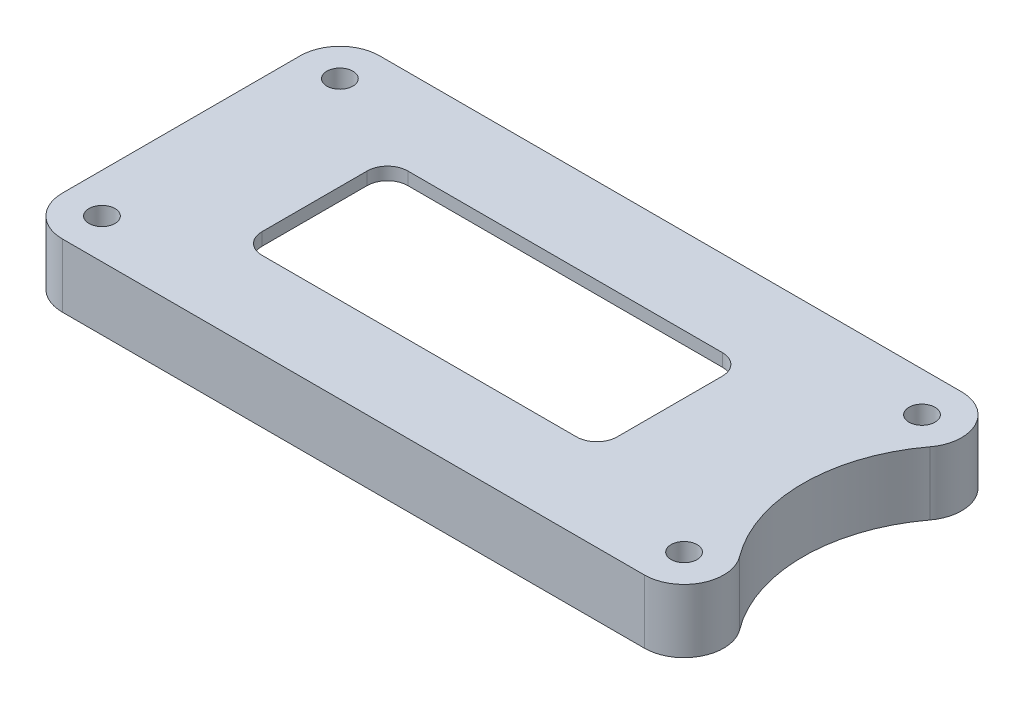
ISO-10303-21;
HEADER;
FILE_DESCRIPTION(('STEP AP214'),'2;1');
FILE_NAME('part.step','',(''),(''),'','','');
FILE_SCHEMA(('AUTOMOTIVE_DESIGN { 1 0 10303 214 1 1 1 1 }'));
ENDSEC;
DATA;
#1=APPLICATION_CONTEXT('core data for automotive mechanical design processes');
#2=APPLICATION_PROTOCOL_DEFINITION('international standard','automotive_design',2000,#1);
#3=PRODUCT_CONTEXT('',#1,'mechanical');
#4=PRODUCT('Part','Part','',(#3));
#5=PRODUCT_RELATED_PRODUCT_CATEGORY('part','',(#4));
#6=PRODUCT_DEFINITION_FORMATION('','',#4);
#7=PRODUCT_DEFINITION_CONTEXT('part definition',#1,'design');
#8=PRODUCT_DEFINITION('design','',#6,#7);
#9=PRODUCT_DEFINITION_SHAPE('','',#8);
#10=(LENGTH_UNIT() NAMED_UNIT(*) SI_UNIT(.MILLI.,.METRE.));
#11=(NAMED_UNIT(*) PLANE_ANGLE_UNIT() SI_UNIT($,.RADIAN.));
#12=(NAMED_UNIT(*) SI_UNIT($,.STERADIAN.) SOLID_ANGLE_UNIT());
#13=UNCERTAINTY_MEASURE_WITH_UNIT(LENGTH_MEASURE(1.E-05),#10,'distance_accuracy_value','');
#14=(GEOMETRIC_REPRESENTATION_CONTEXT(3) GLOBAL_UNCERTAINTY_ASSIGNED_CONTEXT((#13)) GLOBAL_UNIT_ASSIGNED_CONTEXT((#10,
#11,#12)) REPRESENTATION_CONTEXT('',''));
#15=CARTESIAN_POINT('',(0.,0.,0.));
#16=DIRECTION('',(0.,0.,1.));
#17=DIRECTION('',(1.,0.,0.));
#18=AXIS2_PLACEMENT_3D('',#15,#16,#17);
#19=CARTESIAN_POINT('',(0.,5.,0.));
#20=DIRECTION('',(0.,1.,0.));
#21=DIRECTION('',(0.,0.,1.));
#22=AXIS2_PLACEMENT_3D('',#19,#20,#21);
#23=PLANE('',#22);
#24=CARTESIAN_POINT('',(-21.375,5.,-9.37500000000001));
#25=DIRECTION('',(0.,-1.,0.));
#26=DIRECTION('',(0.,0.,-1.));
#27=AXIS2_PLACEMENT_3D('',#24,#25,#26);
#28=CIRCLE('',#27,1.025);
#29=CARTESIAN_POINT('',(-21.375,5.,-10.4));
#30=VERTEX_POINT('',#29);
#31=EDGE_CURVE('E459',#30,#30,#28,.T.);
#32=ORIENTED_EDGE('',*,*,#31,.T.);
#33=EDGE_LOOP('',(#32));
#34=FACE_BOUND('',#33,.T.);
#35=CARTESIAN_POINT('',(24.5,5.,9.37500000000001));
#36=DIRECTION('',(0.,-1.,0.));
#37=DIRECTION('',(0.,0.,-1.));
#38=AXIS2_PLACEMENT_3D('',#35,#36,#37);
#39=CIRCLE('',#38,1.025);
#40=CARTESIAN_POINT('',(24.5,5.,8.35));
#41=VERTEX_POINT('',#40);
#42=EDGE_CURVE('E454',#41,#41,#39,.F.);
#43=ORIENTED_EDGE('',*,*,#42,.F.);
#44=EDGE_LOOP('',(#43));
#45=FACE_BOUND('',#44,.T.);
#46=CARTESIAN_POINT('',(24.5,5.,-9.37500000000001));
#47=DIRECTION('',(0.,-1.,0.));
#48=DIRECTION('',(0.,0.,-1.));
#49=AXIS2_PLACEMENT_3D('',#46,#47,#48);
#50=CIRCLE('',#49,1.025);
#51=CARTESIAN_POINT('',(24.5,5.,-10.4));
#52=VERTEX_POINT('',#51);
#53=EDGE_CURVE('E447',#52,#52,#50,.T.);
#54=ORIENTED_EDGE('',*,*,#53,.T.);
#55=EDGE_LOOP('',(#54));
#56=FACE_BOUND('',#55,.T.);
#57=DIRECTION('',(-1.,0.,0.));
#58=VECTOR('',#57,1.);
#59=CARTESIAN_POINT('',(-22.5,5.,-12.5));
#60=LINE('',#59,#58);
#61=CARTESIAN_POINT('',(24.5,5.,-12.5));
#62=VERTEX_POINT('',#61);
#63=CARTESIAN_POINT('',(-21.375,5.,-12.5));
#64=VERTEX_POINT('',#63);
#65=EDGE_CURVE('E399',#62,#64,#60,.T.);
#66=ORIENTED_EDGE('',*,*,#65,.T.);
#67=CARTESIAN_POINT('',(-21.375,5.,-9.37500000000001));
#68=DIRECTION('',(0.,1.,0.));
#69=DIRECTION('',(0.,0.,1.));
#70=AXIS2_PLACEMENT_3D('',#67,#68,#69);
#71=CIRCLE('',#70,3.125);
#72=CARTESIAN_POINT('',(-24.5,5.,-9.37500000000001));
#73=VERTEX_POINT('',#72);
#74=EDGE_CURVE('E318',#64,#73,#71,.T.);
#75=ORIENTED_EDGE('',*,*,#74,.T.);
#76=DIRECTION('',(0.,0.,1.));
#77=VECTOR('',#76,1.);
#78=CARTESIAN_POINT('',(-24.5,5.,0.));
#79=LINE('',#78,#77);
#80=CARTESIAN_POINT('',(-24.5,5.,9.375));
#81=VERTEX_POINT('',#80);
#82=EDGE_CURVE('E359',#73,#81,#79,.T.);
#83=ORIENTED_EDGE('',*,*,#82,.T.);
#84=CARTESIAN_POINT('',(-21.375,5.,9.375));
#85=DIRECTION('',(0.,1.,0.));
#86=DIRECTION('',(0.,0.,1.));
#87=AXIS2_PLACEMENT_3D('',#84,#85,#86);
#88=CIRCLE('',#87,3.125);
#89=CARTESIAN_POINT('',(-21.375,5.,12.5));
#90=VERTEX_POINT('',#89);
#91=EDGE_CURVE('E316',#81,#90,#88,.T.);
#92=ORIENTED_EDGE('',*,*,#91,.T.);
#93=DIRECTION('',(1.,0.,0.));
#94=VECTOR('',#93,1.);
#95=CARTESIAN_POINT('',(-22.5,5.,12.5));
#96=LINE('',#95,#94);
#97=CARTESIAN_POINT('',(24.5,5.,12.5));
#98=VERTEX_POINT('',#97);
#99=EDGE_CURVE('E239',#90,#98,#96,.T.);
#100=ORIENTED_EDGE('',*,*,#99,.T.);
#101=CARTESIAN_POINT('',(24.5,5.,9.375));
#102=DIRECTION('',(0.,1.,0.));
#103=DIRECTION('',(0.,0.,1.));
#104=AXIS2_PLACEMENT_3D('',#101,#102,#103);
#105=CIRCLE('',#104,3.125);
#106=CARTESIAN_POINT('',(27.,5.,7.5));
#107=VERTEX_POINT('',#106);
#108=EDGE_CURVE('E298',#98,#107,#105,.T.);
#109=ORIENTED_EDGE('',*,*,#108,.T.);
#110=CARTESIAN_POINT('',(37.,5.,0.));
#111=DIRECTION('',(0.,1.,0.));
#112=DIRECTION('',(0.,0.,1.));
#113=AXIS2_PLACEMENT_3D('',#110,#111,#112);
#114=CIRCLE('',#113,12.5);
#115=CARTESIAN_POINT('',(27.,5.,-7.5));
#116=VERTEX_POINT('',#115);
#117=EDGE_CURVE('E362',#107,#116,#114,.F.);
#118=ORIENTED_EDGE('',*,*,#117,.T.);
#119=CARTESIAN_POINT('',(24.5,5.,-9.37500000000001));
#120=DIRECTION('',(0.,1.,0.));
#121=DIRECTION('',(0.,0.,1.));
#122=AXIS2_PLACEMENT_3D('',#119,#120,#121);
#123=CIRCLE('',#122,3.125);
#124=EDGE_CURVE('E300',#116,#62,#123,.T.);
#125=ORIENTED_EDGE('',*,*,#124,.T.);
#126=EDGE_LOOP('',(#66,#75,#83,#92,#100,#109,#118,#125));
#127=FACE_BOUND('',#126,.T.);
#128=DIRECTION('',(0.,0.,-1.));
#129=VECTOR('',#128,1.);
#130=CARTESIAN_POINT('',(14.,5.,5.75));
#131=LINE('',#130,#129);
#132=CARTESIAN_POINT('',(14.,5.,4.15));
#133=VERTEX_POINT('',#132);
#134=CARTESIAN_POINT('',(14.,5.,-4.15));
#135=VERTEX_POINT('',#134);
#136=EDGE_CURVE('E378',#133,#135,#131,.T.);
#137=ORIENTED_EDGE('',*,*,#136,.F.);
#138=CARTESIAN_POINT('',(12.4,5.,4.15));
#139=DIRECTION('',(0.,1.,0.));
#140=DIRECTION('',(0.,0.,1.));
#141=AXIS2_PLACEMENT_3D('',#138,#139,#140);
#142=CIRCLE('',#141,1.6);
#143=CARTESIAN_POINT('',(12.4,5.,5.75));
#144=VERTEX_POINT('',#143);
#145=EDGE_CURVE('E258',#133,#144,#142,.F.);
#146=ORIENTED_EDGE('',*,*,#145,.T.);
#147=DIRECTION('',(1.,0.,0.));
#148=VECTOR('',#147,1.);
#149=CARTESIAN_POINT('',(-14.,5.,5.75));
#150=LINE('',#149,#148);
#151=CARTESIAN_POINT('',(-12.4,5.,5.75));
#152=VERTEX_POINT('',#151);
#153=EDGE_CURVE('E393',#152,#144,#150,.T.);
#154=ORIENTED_EDGE('',*,*,#153,.F.);
#155=CARTESIAN_POINT('',(-12.4,5.,4.15));
#156=DIRECTION('',(0.,1.,0.));
#157=DIRECTION('',(0.,0.,1.));
#158=AXIS2_PLACEMENT_3D('',#155,#156,#157);
#159=CIRCLE('',#158,1.6);
#160=CARTESIAN_POINT('',(-14.,5.,4.15));
#161=VERTEX_POINT('',#160);
#162=EDGE_CURVE('E262',#152,#161,#159,.F.);
#163=ORIENTED_EDGE('',*,*,#162,.T.);
#164=DIRECTION('',(0.,0.,1.));
#165=VECTOR('',#164,1.);
#166=CARTESIAN_POINT('',(-14.,5.,5.75));
#167=LINE('',#166,#165);
#168=CARTESIAN_POINT('',(-14.,5.,-4.15));
#169=VERTEX_POINT('',#168);
#170=EDGE_CURVE('E392',#169,#161,#167,.T.);
#171=ORIENTED_EDGE('',*,*,#170,.F.);
#172=CARTESIAN_POINT('',(-12.4,5.,-4.15));
#173=DIRECTION('',(0.,1.,0.));
#174=DIRECTION('',(0.,0.,1.));
#175=AXIS2_PLACEMENT_3D('',#172,#173,#174);
#176=CIRCLE('',#175,1.6);
#177=CARTESIAN_POINT('',(-12.4,5.,-5.75));
#178=VERTEX_POINT('',#177);
#179=EDGE_CURVE('E221',#169,#178,#176,.F.);
#180=ORIENTED_EDGE('',*,*,#179,.T.);
#181=DIRECTION('',(-1.,0.,0.));
#182=VECTOR('',#181,1.);
#183=CARTESIAN_POINT('',(-14.,5.,-5.75));
#184=LINE('',#183,#182);
#185=CARTESIAN_POINT('',(12.4,5.,-5.75));
#186=VERTEX_POINT('',#185);
#187=EDGE_CURVE('E389',#186,#178,#184,.T.);
#188=ORIENTED_EDGE('',*,*,#187,.F.);
#189=CARTESIAN_POINT('',(12.4,5.,-4.15));
#190=DIRECTION('',(0.,1.,0.));
#191=DIRECTION('',(0.,0.,1.));
#192=AXIS2_PLACEMENT_3D('',#189,#190,#191);
#193=CIRCLE('',#192,1.6);
#194=EDGE_CURVE('E220',#186,#135,#193,.F.);
#195=ORIENTED_EDGE('',*,*,#194,.T.);
#196=EDGE_LOOP('',(#137,#146,#154,#163,#171,#180,#188,#195));
#197=FACE_BOUND('',#196,.T.);
#198=CARTESIAN_POINT('',(-21.375,5.,9.37500000000001));
#199=DIRECTION('',(0.,-1.,0.));
#200=DIRECTION('',(0.,0.,-1.));
#201=AXIS2_PLACEMENT_3D('',#198,#199,#200);
#202=CIRCLE('',#201,1.025);
#203=CARTESIAN_POINT('',(-21.375,5.,8.35));
#204=VERTEX_POINT('',#203);
#205=EDGE_CURVE('E465',#204,#204,#202,.F.);
#206=ORIENTED_EDGE('',*,*,#205,.F.);
#207=EDGE_LOOP('',(#206));
#208=FACE_BOUND('',#207,.T.);
#209=ADVANCED_FACE('F45',(#34,#45,#56,#127,#197,#208),#23,.T.);
#210=CARTESIAN_POINT('',(0.,0.,0.));
#211=DIRECTION('',(0.,1.,0.));
#212=DIRECTION('',(0.,0.,1.));
#213=AXIS2_PLACEMENT_3D('',#210,#211,#212);
#214=PLANE('',#213);
#215=CARTESIAN_POINT('',(-21.375,0.,-9.37500000000001));
#216=DIRECTION('',(0.,-1.,0.));
#217=DIRECTION('',(0.,0.,-1.));
#218=AXIS2_PLACEMENT_3D('',#215,#216,#217);
#219=CIRCLE('',#218,1.025);
#220=CARTESIAN_POINT('',(-21.375,0.,-10.4));
#221=VERTEX_POINT('',#220);
#222=EDGE_CURVE('E456',#221,#221,#219,.T.);
#223=ORIENTED_EDGE('',*,*,#222,.F.);
#224=EDGE_LOOP('',(#223));
#225=FACE_BOUND('',#224,.T.);
#226=CARTESIAN_POINT('',(24.5,0.,-9.37500000000001));
#227=DIRECTION('',(0.,-1.,0.));
#228=DIRECTION('',(0.,0.,-1.));
#229=AXIS2_PLACEMENT_3D('',#226,#227,#228);
#230=CIRCLE('',#229,1.025);
#231=CARTESIAN_POINT('',(24.5,0.,-10.4));
#232=VERTEX_POINT('',#231);
#233=EDGE_CURVE('E450',#232,#232,#230,.T.);
#234=ORIENTED_EDGE('',*,*,#233,.F.);
#235=EDGE_LOOP('',(#234));
#236=FACE_BOUND('',#235,.T.);
#237=DIRECTION('',(-1.,0.,0.));
#238=VECTOR('',#237,1.);
#239=CARTESIAN_POINT('',(-22.5,0.,-11.5));
#240=LINE('',#239,#238);
#241=CARTESIAN_POINT('',(18.375,0.,-11.5));
#242=VERTEX_POINT('',#241);
#243=CARTESIAN_POINT('',(-15.25,0.,-11.5));
#244=VERTEX_POINT('',#243);
#245=EDGE_CURVE('E352',#242,#244,#240,.T.);
#246=ORIENTED_EDGE('',*,*,#245,.T.);
#247=CARTESIAN_POINT('',(-15.25,0.,-8.375));
#248=DIRECTION('',(0.,1.,0.));
#249=DIRECTION('',(0.,0.,1.));
#250=AXIS2_PLACEMENT_3D('',#247,#248,#249);
#251=CIRCLE('',#250,3.125);
#252=CARTESIAN_POINT('',(-18.375,0.,-8.375));
#253=VERTEX_POINT('',#252);
#254=EDGE_CURVE('E12',#244,#253,#251,.T.);
#255=ORIENTED_EDGE('',*,*,#254,.T.);
#256=DIRECTION('',(0.,0.,1.));
#257=VECTOR('',#256,1.);
#258=CARTESIAN_POINT('',(-18.375,0.,0.));
#259=LINE('',#258,#257);
#260=CARTESIAN_POINT('',(-18.375,0.,8.375));
#261=VERTEX_POINT('',#260);
#262=EDGE_CURVE('E343',#253,#261,#259,.T.);
#263=ORIENTED_EDGE('',*,*,#262,.T.);
#264=CARTESIAN_POINT('',(-15.25,0.,8.375));
#265=DIRECTION('',(0.,1.,0.));
#266=DIRECTION('',(0.,0.,1.));
#267=AXIS2_PLACEMENT_3D('',#264,#265,#266);
#268=CIRCLE('',#267,3.125);
#269=CARTESIAN_POINT('',(-15.25,0.,11.5));
#270=VERTEX_POINT('',#269);
#271=EDGE_CURVE('E53',#261,#270,#268,.T.);
#272=ORIENTED_EDGE('',*,*,#271,.T.);
#273=DIRECTION('',(1.,0.,0.));
#274=VECTOR('',#273,1.);
#275=CARTESIAN_POINT('',(-22.5,0.,11.5));
#276=LINE('',#275,#274);
#277=CARTESIAN_POINT('',(18.375,0.,11.5));
#278=VERTEX_POINT('',#277);
#279=EDGE_CURVE('E341',#270,#278,#276,.T.);
#280=ORIENTED_EDGE('',*,*,#279,.T.);
#281=CARTESIAN_POINT('',(18.375,0.,8.375));
#282=DIRECTION('',(0.,1.,0.));
#283=DIRECTION('',(0.,0.,1.));
#284=AXIS2_PLACEMENT_3D('',#281,#282,#283);
#285=CIRCLE('',#284,3.125);
#286=CARTESIAN_POINT('',(21.5,0.,8.375));
#287=VERTEX_POINT('',#286);
#288=EDGE_CURVE('E281',#278,#287,#285,.T.);
#289=ORIENTED_EDGE('',*,*,#288,.T.);
#290=DIRECTION('',(0.,0.,-1.));
#291=VECTOR('',#290,1.);
#292=CARTESIAN_POINT('',(21.5,0.,-12.5));
#293=LINE('',#292,#291);
#294=CARTESIAN_POINT('',(21.5,0.,-8.375));
#295=VERTEX_POINT('',#294);
#296=EDGE_CURVE('E379',#287,#295,#293,.T.);
#297=ORIENTED_EDGE('',*,*,#296,.T.);
#298=CARTESIAN_POINT('',(18.375,0.,-8.375));
#299=DIRECTION('',(0.,1.,0.));
#300=DIRECTION('',(0.,0.,1.));
#301=AXIS2_PLACEMENT_3D('',#298,#299,#300);
#302=CIRCLE('',#301,3.125);
#303=EDGE_CURVE('E283',#295,#242,#302,.T.);
#304=ORIENTED_EDGE('',*,*,#303,.T.);
#305=EDGE_LOOP('',(#246,#255,#263,#272,#280,#289,#297,#304));
#306=FACE_BOUND('',#305,.T.);
#307=DIRECTION('',(0.,0.,1.));
#308=VECTOR('',#307,1.);
#309=CARTESIAN_POINT('',(-24.5,0.,0.));
#310=LINE('',#309,#308);
#311=CARTESIAN_POINT('',(-24.5,0.,-9.37500000000001));
#312=VERTEX_POINT('',#311);
#313=CARTESIAN_POINT('',(-24.5,0.,9.375));
#314=VERTEX_POINT('',#313);
#315=EDGE_CURVE('E444',#312,#314,#310,.T.);
#316=ORIENTED_EDGE('',*,*,#315,.F.);
#317=CARTESIAN_POINT('',(-21.375,0.,-9.37500000000001));
#318=DIRECTION('',(0.,1.,0.));
#319=DIRECTION('',(0.,0.,1.));
#320=AXIS2_PLACEMENT_3D('',#317,#318,#319);
#321=CIRCLE('',#320,3.125);
#322=CARTESIAN_POINT('',(-21.375,0.,-12.5));
#323=VERTEX_POINT('',#322);
#324=EDGE_CURVE('E312',#312,#323,#321,.F.);
#325=ORIENTED_EDGE('',*,*,#324,.T.);
#326=DIRECTION('',(-1.,0.,0.));
#327=VECTOR('',#326,1.);
#328=CARTESIAN_POINT('',(-22.5,0.,-12.5));
#329=LINE('',#328,#327);
#330=CARTESIAN_POINT('',(24.5,0.,-12.5));
#331=VERTEX_POINT('',#330);
#332=EDGE_CURVE('E398',#331,#323,#329,.T.);
#333=ORIENTED_EDGE('',*,*,#332,.F.);
#334=CARTESIAN_POINT('',(24.5,0.,-9.37500000000001));
#335=DIRECTION('',(0.,1.,0.));
#336=DIRECTION('',(0.,0.,1.));
#337=AXIS2_PLACEMENT_3D('',#334,#335,#336);
#338=CIRCLE('',#337,3.125);
#339=CARTESIAN_POINT('',(27.,0.,-7.5));
#340=VERTEX_POINT('',#339);
#341=EDGE_CURVE('E291',#331,#340,#338,.F.);
#342=ORIENTED_EDGE('',*,*,#341,.T.);
#343=CARTESIAN_POINT('',(37.,0.,0.));
#344=DIRECTION('',(0.,-1.,0.));
#345=DIRECTION('',(0.,0.,-1.));
#346=AXIS2_PLACEMENT_3D('',#343,#344,#345);
#347=CIRCLE('',#346,12.5);
#348=CARTESIAN_POINT('',(27.,0.,7.5));
#349=VERTEX_POINT('',#348);
#350=EDGE_CURVE('E358',#349,#340,#347,.T.);
#351=ORIENTED_EDGE('',*,*,#350,.F.);
#352=CARTESIAN_POINT('',(24.5,0.,9.375));
#353=DIRECTION('',(0.,1.,0.));
#354=DIRECTION('',(0.,0.,1.));
#355=AXIS2_PLACEMENT_3D('',#352,#353,#354);
#356=CIRCLE('',#355,3.125);
#357=CARTESIAN_POINT('',(24.5,0.,12.5));
#358=VERTEX_POINT('',#357);
#359=EDGE_CURVE('E288',#349,#358,#356,.F.);
#360=ORIENTED_EDGE('',*,*,#359,.T.);
#361=DIRECTION('',(1.,0.,0.));
#362=VECTOR('',#361,1.);
#363=CARTESIAN_POINT('',(-22.5,0.,12.5));
#364=LINE('',#363,#362);
#365=CARTESIAN_POINT('',(-21.375,0.,12.5));
#366=VERTEX_POINT('',#365);
#367=EDGE_CURVE('E403',#366,#358,#364,.T.);
#368=ORIENTED_EDGE('',*,*,#367,.F.);
#369=CARTESIAN_POINT('',(-21.375,0.,9.375));
#370=DIRECTION('',(0.,1.,0.));
#371=DIRECTION('',(0.,0.,1.));
#372=AXIS2_PLACEMENT_3D('',#369,#370,#371);
#373=CIRCLE('',#372,3.125);
#374=EDGE_CURVE('E310',#366,#314,#373,.F.);
#375=ORIENTED_EDGE('',*,*,#374,.T.);
#376=EDGE_LOOP('',(#316,#325,#333,#342,#351,#360,#368,#375));
#377=FACE_BOUND('',#376,.T.);
#378=CARTESIAN_POINT('',(24.5,0.,9.37500000000001));
#379=DIRECTION('',(0.,-1.,0.));
#380=DIRECTION('',(0.,0.,-1.));
#381=AXIS2_PLACEMENT_3D('',#378,#379,#380);
#382=CIRCLE('',#381,1.025);
#383=CARTESIAN_POINT('',(24.5,0.,8.35));
#384=VERTEX_POINT('',#383);
#385=EDGE_CURVE('E468',#384,#384,#382,.F.);
#386=ORIENTED_EDGE('',*,*,#385,.T.);
#387=EDGE_LOOP('',(#386));
#388=FACE_BOUND('',#387,.T.);
#389=CARTESIAN_POINT('',(-21.375,0.,9.37500000000001));
#390=DIRECTION('',(0.,-1.,0.));
#391=DIRECTION('',(0.,0.,-1.));
#392=AXIS2_PLACEMENT_3D('',#389,#390,#391);
#393=CIRCLE('',#392,1.025);
#394=CARTESIAN_POINT('',(-21.375,0.,8.35));
#395=VERTEX_POINT('',#394);
#396=EDGE_CURVE('E462',#395,#395,#393,.F.);
#397=ORIENTED_EDGE('',*,*,#396,.T.);
#398=EDGE_LOOP('',(#397));
#399=FACE_BOUND('',#398,.T.);
#400=ADVANCED_FACE('F339',(#225,#236,#306,#377,#388,#399),#214,.F.);
#401=CARTESIAN_POINT('',(14.,0.,5.75));
#402=DIRECTION('',(1.,0.,0.));
#403=DIRECTION('',(0.,0.,-1.));
#404=AXIS2_PLACEMENT_3D('',#401,#402,#403);
#405=PLANE('',#404);
#406=ORIENTED_EDGE('',*,*,#136,.T.);
#407=DIRECTION('',(0.,1.,0.));
#408=VECTOR('',#407,1.);
#409=CARTESIAN_POINT('',(14.,4.,-4.15));
#410=LINE('',#409,#408);
#411=CARTESIAN_POINT('',(14.,4.,-4.15));
#412=VERTEX_POINT('',#411);
#413=EDGE_CURVE('E247',#135,#412,#410,.F.);
#414=ORIENTED_EDGE('',*,*,#413,.T.);
#415=DIRECTION('',(0.,0.,-1.));
#416=VECTOR('',#415,1.);
#417=CARTESIAN_POINT('',(14.,4.,0.));
#418=LINE('',#417,#416);
#419=CARTESIAN_POINT('',(14.,4.,4.15));
#420=VERTEX_POINT('',#419);
#421=EDGE_CURVE('E370',#420,#412,#418,.T.);
#422=ORIENTED_EDGE('',*,*,#421,.F.);
#423=DIRECTION('',(0.,1.,0.));
#424=VECTOR('',#423,1.);
#425=CARTESIAN_POINT('',(14.,5.,4.15));
#426=LINE('',#425,#424);
#427=EDGE_CURVE('E244',#420,#133,#426,.T.);
#428=ORIENTED_EDGE('',*,*,#427,.T.);
#429=EDGE_LOOP('',(#406,#414,#422,#428));
#430=FACE_BOUND('',#429,.T.);
#431=ADVANCED_FACE('F490',(#430),#405,.F.);
#432=CARTESIAN_POINT('',(-14.,0.,5.75));
#433=DIRECTION('',(0.,0.,1.));
#434=DIRECTION('',(1.,0.,0.));
#435=AXIS2_PLACEMENT_3D('',#432,#433,#434);
#436=PLANE('',#435);
#437=ORIENTED_EDGE('',*,*,#153,.T.);
#438=DIRECTION('',(0.,1.,0.));
#439=VECTOR('',#438,1.);
#440=CARTESIAN_POINT('',(12.4,4.,5.75));
#441=LINE('',#440,#439);
#442=CARTESIAN_POINT('',(12.4,4.,5.75));
#443=VERTEX_POINT('',#442);
#444=EDGE_CURVE('E252',#144,#443,#441,.F.);
#445=ORIENTED_EDGE('',*,*,#444,.T.);
#446=DIRECTION('',(1.,0.,0.));
#447=VECTOR('',#446,1.);
#448=CARTESIAN_POINT('',(0.,4.,5.75));
#449=LINE('',#448,#447);
#450=CARTESIAN_POINT('',(-12.4,4.,5.75));
#451=VERTEX_POINT('',#450);
#452=EDGE_CURVE('E231',#451,#443,#449,.T.);
#453=ORIENTED_EDGE('',*,*,#452,.F.);
#454=DIRECTION('',(0.,1.,0.));
#455=VECTOR('',#454,1.);
#456=CARTESIAN_POINT('',(-12.4,5.,5.75));
#457=LINE('',#456,#455);
#458=EDGE_CURVE('E249',#451,#152,#457,.T.);
#459=ORIENTED_EDGE('',*,*,#458,.T.);
#460=EDGE_LOOP('',(#437,#445,#453,#459));
#461=FACE_BOUND('',#460,.T.);
#462=ADVANCED_FACE('F496',(#461),#436,.F.);
#463=CARTESIAN_POINT('',(-14.,0.,5.75));
#464=DIRECTION('',(-1.,0.,0.));
#465=DIRECTION('',(0.,0.,1.));
#466=AXIS2_PLACEMENT_3D('',#463,#464,#465);
#467=PLANE('',#466);
#468=DIRECTION('',(0.,0.,1.));
#469=VECTOR('',#468,1.);
#470=CARTESIAN_POINT('',(-14.,4.,0.));
#471=LINE('',#470,#469);
#472=CARTESIAN_POINT('',(-14.,4.,-4.15));
#473=VERTEX_POINT('',#472);
#474=CARTESIAN_POINT('',(-14.,4.,4.15));
#475=VERTEX_POINT('',#474);
#476=EDGE_CURVE('E213',#473,#475,#471,.T.);
#477=ORIENTED_EDGE('',*,*,#476,.F.);
#478=DIRECTION('',(0.,1.,0.));
#479=VECTOR('',#478,1.);
#480=CARTESIAN_POINT('',(-14.,5.,-4.15));
#481=LINE('',#480,#479);
#482=EDGE_CURVE('E227',#473,#169,#481,.T.);
#483=ORIENTED_EDGE('',*,*,#482,.T.);
#484=ORIENTED_EDGE('',*,*,#170,.T.);
#485=DIRECTION('',(0.,1.,0.));
#486=VECTOR('',#485,1.);
#487=CARTESIAN_POINT('',(-14.,4.,4.15));
#488=LINE('',#487,#486);
#489=EDGE_CURVE('E230',#161,#475,#488,.F.);
#490=ORIENTED_EDGE('',*,*,#489,.T.);
#491=EDGE_LOOP('',(#477,#483,#484,#490));
#492=FACE_BOUND('',#491,.T.);
#493=ADVANCED_FACE('F225',(#492),#467,.F.);
#494=CARTESIAN_POINT('',(-14.,0.,-5.75));
#495=DIRECTION('',(0.,0.,-1.));
#496=DIRECTION('',(-1.,0.,0.));
#497=AXIS2_PLACEMENT_3D('',#494,#495,#496);
#498=PLANE('',#497);
#499=ORIENTED_EDGE('',*,*,#187,.T.);
#500=DIRECTION('',(0.,1.,0.));
#501=VECTOR('',#500,1.);
#502=CARTESIAN_POINT('',(-12.4,4.,-5.75));
#503=LINE('',#502,#501);
#504=CARTESIAN_POINT('',(-12.4,4.,-5.75));
#505=VERTEX_POINT('',#504);
#506=EDGE_CURVE('E237',#178,#505,#503,.F.);
#507=ORIENTED_EDGE('',*,*,#506,.T.);
#508=DIRECTION('',(-1.,0.,0.));
#509=VECTOR('',#508,1.);
#510=CARTESIAN_POINT('',(0.,4.,-5.75));
#511=LINE('',#510,#509);
#512=CARTESIAN_POINT('',(12.4,4.,-5.75));
#513=VERTEX_POINT('',#512);
#514=EDGE_CURVE('E216',#513,#505,#511,.T.);
#515=ORIENTED_EDGE('',*,*,#514,.F.);
#516=DIRECTION('',(0.,1.,0.));
#517=VECTOR('',#516,1.);
#518=CARTESIAN_POINT('',(12.4,5.,-5.75));
#519=LINE('',#518,#517);
#520=EDGE_CURVE('E234',#513,#186,#519,.T.);
#521=ORIENTED_EDGE('',*,*,#520,.T.);
#522=EDGE_LOOP('',(#499,#507,#515,#521));
#523=FACE_BOUND('',#522,.T.);
#524=ADVANCED_FACE('F506',(#523),#498,.F.);
#525=CARTESIAN_POINT('',(-22.5,5.,-12.5));
#526=DIRECTION('',(0.,0.,1.));
#527=DIRECTION('',(1.,0.,0.));
#528=AXIS2_PLACEMENT_3D('',#525,#526,#527);
#529=PLANE('',#528);
#530=ORIENTED_EDGE('',*,*,#332,.T.);
#531=DIRECTION('',(0.,-1.,0.));
#532=VECTOR('',#531,1.);
#533=CARTESIAN_POINT('',(-21.375,5.,-12.5));
#534=LINE('',#533,#532);
#535=EDGE_CURVE('E314',#323,#64,#534,.F.);
#536=ORIENTED_EDGE('',*,*,#535,.T.);
#537=ORIENTED_EDGE('',*,*,#65,.F.);
#538=DIRECTION('',(0.,-1.,0.));
#539=VECTOR('',#538,1.);
#540=CARTESIAN_POINT('',(24.5,5.,-12.5));
#541=LINE('',#540,#539);
#542=EDGE_CURVE('E285',#62,#331,#541,.T.);
#543=ORIENTED_EDGE('',*,*,#542,.T.);
#544=EDGE_LOOP('',(#530,#536,#537,#543));
#545=FACE_BOUND('',#544,.T.);
#546=ADVANCED_FACE('F432',(#545),#529,.F.);
#547=CARTESIAN_POINT('',(-22.5,5.,12.5));
#548=DIRECTION('',(0.,0.,-1.));
#549=DIRECTION('',(-1.,0.,0.));
#550=AXIS2_PLACEMENT_3D('',#547,#548,#549);
#551=PLANE('',#550);
#552=ORIENTED_EDGE('',*,*,#99,.F.);
#553=DIRECTION('',(0.,-1.,0.));
#554=VECTOR('',#553,1.);
#555=CARTESIAN_POINT('',(-21.375,5.,12.5));
#556=LINE('',#555,#554);
#557=EDGE_CURVE('E320',#90,#366,#556,.T.);
#558=ORIENTED_EDGE('',*,*,#557,.T.);
#559=ORIENTED_EDGE('',*,*,#367,.T.);
#560=DIRECTION('',(0.,-1.,0.));
#561=VECTOR('',#560,1.);
#562=CARTESIAN_POINT('',(24.5,5.,12.5));
#563=LINE('',#562,#561);
#564=EDGE_CURVE('E302',#358,#98,#563,.F.);
#565=ORIENTED_EDGE('',*,*,#564,.T.);
#566=EDGE_LOOP('',(#552,#558,#559,#565));
#567=FACE_BOUND('',#566,.T.);
#568=ADVANCED_FACE('F409',(#567),#551,.F.);
#569=CARTESIAN_POINT('',(21.5,5.,-12.5));
#570=DIRECTION('',(-1.,0.,0.));
#571=DIRECTION('',(0.,0.,1.));
#572=AXIS2_PLACEMENT_3D('',#569,#570,#571);
#573=PLANE('',#572);
#574=ORIENTED_EDGE('',*,*,#296,.F.);
#575=DIRECTION('',(0.,-1.,0.));
#576=VECTOR('',#575,1.);
#577=CARTESIAN_POINT('',(21.5,4.,8.375));
#578=LINE('',#577,#576);
#579=CARTESIAN_POINT('',(21.5,4.,8.375));
#580=VERTEX_POINT('',#579);
#581=EDGE_CURVE('E279',#287,#580,#578,.F.);
#582=ORIENTED_EDGE('',*,*,#581,.T.);
#583=DIRECTION('',(0.,0.,-1.));
#584=VECTOR('',#583,1.);
#585=CARTESIAN_POINT('',(21.5,4.,-12.5));
#586=LINE('',#585,#584);
#587=CARTESIAN_POINT('',(21.5,4.,-8.375));
#588=VERTEX_POINT('',#587);
#589=EDGE_CURVE('E351',#580,#588,#586,.T.);
#590=ORIENTED_EDGE('',*,*,#589,.T.);
#591=DIRECTION('',(0.,-1.,0.));
#592=VECTOR('',#591,1.);
#593=CARTESIAN_POINT('',(21.5,0.,-8.375));
#594=LINE('',#593,#592);
#595=EDGE_CURVE('E276',#588,#295,#594,.T.);
#596=ORIENTED_EDGE('',*,*,#595,.T.);
#597=EDGE_LOOP('',(#574,#582,#590,#596));
#598=FACE_BOUND('',#597,.T.);
#599=ADVANCED_FACE('F503',(#598),#573,.T.);
#600=CARTESIAN_POINT('',(-22.5,5.,-11.5));
#601=DIRECTION('',(0.,0.,1.));
#602=DIRECTION('',(1.,0.,0.));
#603=AXIS2_PLACEMENT_3D('',#600,#601,#602);
#604=PLANE('',#603);
#605=DIRECTION('',(-1.,0.,0.));
#606=VECTOR('',#605,1.);
#607=CARTESIAN_POINT('',(-22.5,4.,-11.5));
#608=LINE('',#607,#606);
#609=CARTESIAN_POINT('',(18.375,4.,-11.5));
#610=VERTEX_POINT('',#609);
#611=CARTESIAN_POINT('',(-15.25,4.,-11.5));
#612=VERTEX_POINT('',#611);
#613=EDGE_CURVE('E373',#610,#612,#608,.T.);
#614=ORIENTED_EDGE('',*,*,#613,.T.);
#615=DIRECTION('',(0.,-1.,0.));
#616=VECTOR('',#615,1.);
#617=CARTESIAN_POINT('',(-15.25,0.,-11.5));
#618=LINE('',#617,#616);
#619=EDGE_CURVE('E332',#612,#244,#618,.T.);
#620=ORIENTED_EDGE('',*,*,#619,.T.);
#621=ORIENTED_EDGE('',*,*,#245,.F.);
#622=DIRECTION('',(0.,-1.,0.));
#623=VECTOR('',#622,1.);
#624=CARTESIAN_POINT('',(18.375,4.,-11.5));
#625=LINE('',#624,#623);
#626=EDGE_CURVE('E274',#242,#610,#625,.F.);
#627=ORIENTED_EDGE('',*,*,#626,.T.);
#628=EDGE_LOOP('',(#614,#620,#621,#627));
#629=FACE_BOUND('',#628,.T.);
#630=ADVANCED_FACE('F546',(#629),#604,.T.);
#631=CARTESIAN_POINT('',(-22.5,5.,11.5));
#632=DIRECTION('',(0.,0.,-1.));
#633=DIRECTION('',(-1.,0.,0.));
#634=AXIS2_PLACEMENT_3D('',#631,#632,#633);
#635=PLANE('',#634);
#636=ORIENTED_EDGE('',*,*,#279,.F.);
#637=DIRECTION('',(0.,1.,0.));
#638=VECTOR('',#637,1.);
#639=CARTESIAN_POINT('',(-15.25,4.,11.5));
#640=LINE('',#639,#638);
#641=CARTESIAN_POINT('',(-15.25,4.,11.5));
#642=VERTEX_POINT('',#641);
#643=EDGE_CURVE('E323',#270,#642,#640,.T.);
#644=ORIENTED_EDGE('',*,*,#643,.T.);
#645=DIRECTION('',(1.,0.,0.));
#646=VECTOR('',#645,1.);
#647=CARTESIAN_POINT('',(-22.5,4.,11.5));
#648=LINE('',#647,#646);
#649=CARTESIAN_POINT('',(18.375,4.,11.5));
#650=VERTEX_POINT('',#649);
#651=EDGE_CURVE('E356',#642,#650,#648,.T.);
#652=ORIENTED_EDGE('',*,*,#651,.T.);
#653=DIRECTION('',(0.,-1.,0.));
#654=VECTOR('',#653,1.);
#655=CARTESIAN_POINT('',(18.375,0.,11.5));
#656=LINE('',#655,#654);
#657=EDGE_CURVE('E266',#650,#278,#656,.T.);
#658=ORIENTED_EDGE('',*,*,#657,.T.);
#659=EDGE_LOOP('',(#636,#644,#652,#658));
#660=FACE_BOUND('',#659,.T.);
#661=ADVANCED_FACE('F348',(#660),#635,.T.);
#662=CARTESIAN_POINT('',(0.,4.,0.));
#663=DIRECTION('',(0.,1.,0.));
#664=DIRECTION('',(0.,0.,1.));
#665=AXIS2_PLACEMENT_3D('',#662,#663,#664);
#666=PLANE('',#665);
#667=ORIENTED_EDGE('',*,*,#452,.T.);
#668=CARTESIAN_POINT('',(12.4,4.,4.15));
#669=DIRECTION('',(0.,1.,0.));
#670=DIRECTION('',(0.,0.,1.));
#671=AXIS2_PLACEMENT_3D('',#668,#669,#670);
#672=CIRCLE('',#671,1.6);
#673=EDGE_CURVE('E260',#443,#420,#672,.T.);
#674=ORIENTED_EDGE('',*,*,#673,.T.);
#675=ORIENTED_EDGE('',*,*,#421,.T.);
#676=CARTESIAN_POINT('',(12.4,4.,-4.15));
#677=DIRECTION('',(0.,1.,0.));
#678=DIRECTION('',(0.,0.,1.));
#679=AXIS2_PLACEMENT_3D('',#676,#677,#678);
#680=CIRCLE('',#679,1.6);
#681=EDGE_CURVE('E256',#412,#513,#680,.T.);
#682=ORIENTED_EDGE('',*,*,#681,.T.);
#683=ORIENTED_EDGE('',*,*,#514,.T.);
#684=CARTESIAN_POINT('',(-12.4,4.,-4.15));
#685=DIRECTION('',(0.,1.,0.));
#686=DIRECTION('',(0.,0.,1.));
#687=AXIS2_PLACEMENT_3D('',#684,#685,#686);
#688=CIRCLE('',#687,1.6);
#689=EDGE_CURVE('E209',#505,#473,#688,.T.);
#690=ORIENTED_EDGE('',*,*,#689,.T.);
#691=ORIENTED_EDGE('',*,*,#476,.T.);
#692=CARTESIAN_POINT('',(-12.4,4.,4.15));
#693=DIRECTION('',(0.,1.,0.));
#694=DIRECTION('',(0.,0.,1.));
#695=AXIS2_PLACEMENT_3D('',#692,#693,#694);
#696=CIRCLE('',#695,1.6);
#697=EDGE_CURVE('E264',#475,#451,#696,.T.);
#698=ORIENTED_EDGE('',*,*,#697,.T.);
#699=EDGE_LOOP('',(#667,#674,#675,#682,#683,#690,#691,#698));
#700=FACE_BOUND('',#699,.T.);
#701=ORIENTED_EDGE('',*,*,#651,.F.);
#702=CARTESIAN_POINT('',(-15.25,4.,8.375));
#703=DIRECTION('',(0.,1.,0.));
#704=DIRECTION('',(0.,0.,1.));
#705=AXIS2_PLACEMENT_3D('',#702,#703,#704);
#706=CIRCLE('',#705,3.125);
#707=CARTESIAN_POINT('',(-18.375,4.,8.375));
#708=VERTEX_POINT('',#707);
#709=EDGE_CURVE('E327',#642,#708,#706,.F.);
#710=ORIENTED_EDGE('',*,*,#709,.T.);
#711=DIRECTION('',(0.,0.,-1.));
#712=VECTOR('',#711,1.);
#713=CARTESIAN_POINT('',(-18.375,4.,0.));
#714=LINE('',#713,#712);
#715=CARTESIAN_POINT('',(-18.375,4.,-8.375));
#716=VERTEX_POINT('',#715);
#717=EDGE_CURVE('E355',#708,#716,#714,.T.);
#718=ORIENTED_EDGE('',*,*,#717,.T.);
#719=CARTESIAN_POINT('',(-15.25,4.,-8.375));
#720=DIRECTION('',(0.,1.,0.));
#721=DIRECTION('',(0.,0.,1.));
#722=AXIS2_PLACEMENT_3D('',#719,#720,#721);
#723=CIRCLE('',#722,3.125);
#724=EDGE_CURVE('E60',#716,#612,#723,.F.);
#725=ORIENTED_EDGE('',*,*,#724,.T.);
#726=ORIENTED_EDGE('',*,*,#613,.F.);
#727=CARTESIAN_POINT('',(18.375,4.,-8.375));
#728=DIRECTION('',(0.,1.,0.));
#729=DIRECTION('',(0.,0.,1.));
#730=AXIS2_PLACEMENT_3D('',#727,#728,#729);
#731=CIRCLE('',#730,3.125);
#732=EDGE_CURVE('E269',#610,#588,#731,.F.);
#733=ORIENTED_EDGE('',*,*,#732,.T.);
#734=ORIENTED_EDGE('',*,*,#589,.F.);
#735=CARTESIAN_POINT('',(18.375,4.,8.375));
#736=DIRECTION('',(0.,1.,0.));
#737=DIRECTION('',(0.,0.,1.));
#738=AXIS2_PLACEMENT_3D('',#735,#736,#737);
#739=CIRCLE('',#738,3.125);
#740=EDGE_CURVE('E271',#580,#650,#739,.F.);
#741=ORIENTED_EDGE('',*,*,#740,.T.);
#742=EDGE_LOOP('',(#701,#710,#718,#725,#726,#733,#734,#741));
#743=FACE_BOUND('',#742,.T.);
#744=ADVANCED_FACE('F212',(#700,#743),#666,.F.);
#745=CARTESIAN_POINT('',(-12.4,0.,-4.15));
#746=DIRECTION('',(0.,-1.,0.));
#747=DIRECTION('',(0.,0.,-1.));
#748=AXIS2_PLACEMENT_3D('',#745,#746,#747);
#749=CYLINDRICAL_SURFACE('',#748,1.6);
#750=ORIENTED_EDGE('',*,*,#689,.F.);
#751=ORIENTED_EDGE('',*,*,#506,.F.);
#752=ORIENTED_EDGE('',*,*,#179,.F.);
#753=ORIENTED_EDGE('',*,*,#482,.F.);
#754=EDGE_LOOP('',(#750,#751,#752,#753));
#755=FACE_BOUND('',#754,.T.);
#756=ADVANCED_FACE('F233',(#755),#749,.F.);
#757=CARTESIAN_POINT('',(12.4,0.,-4.15));
#758=DIRECTION('',(0.,-1.,0.));
#759=DIRECTION('',(0.,0.,-1.));
#760=AXIS2_PLACEMENT_3D('',#757,#758,#759);
#761=CYLINDRICAL_SURFACE('',#760,1.6);
#762=ORIENTED_EDGE('',*,*,#681,.F.);
#763=ORIENTED_EDGE('',*,*,#413,.F.);
#764=ORIENTED_EDGE('',*,*,#194,.F.);
#765=ORIENTED_EDGE('',*,*,#520,.F.);
#766=EDGE_LOOP('',(#762,#763,#764,#765));
#767=FACE_BOUND('',#766,.T.);
#768=ADVANCED_FACE('F509',(#767),#761,.F.);
#769=CARTESIAN_POINT('',(12.4,0.,4.15));
#770=DIRECTION('',(0.,-1.,0.));
#771=DIRECTION('',(0.,0.,-1.));
#772=AXIS2_PLACEMENT_3D('',#769,#770,#771);
#773=CYLINDRICAL_SURFACE('',#772,1.6);
#774=ORIENTED_EDGE('',*,*,#673,.F.);
#775=ORIENTED_EDGE('',*,*,#444,.F.);
#776=ORIENTED_EDGE('',*,*,#145,.F.);
#777=ORIENTED_EDGE('',*,*,#427,.F.);
#778=EDGE_LOOP('',(#774,#775,#776,#777));
#779=FACE_BOUND('',#778,.T.);
#780=ADVANCED_FACE('F512',(#779),#773,.F.);
#781=CARTESIAN_POINT('',(-12.4,0.,4.15));
#782=DIRECTION('',(0.,-1.,0.));
#783=DIRECTION('',(0.,0.,-1.));
#784=AXIS2_PLACEMENT_3D('',#781,#782,#783);
#785=CYLINDRICAL_SURFACE('',#784,1.6);
#786=ORIENTED_EDGE('',*,*,#697,.F.);
#787=ORIENTED_EDGE('',*,*,#489,.F.);
#788=ORIENTED_EDGE('',*,*,#162,.F.);
#789=ORIENTED_EDGE('',*,*,#458,.F.);
#790=EDGE_LOOP('',(#786,#787,#788,#789));
#791=FACE_BOUND('',#790,.T.);
#792=ADVANCED_FACE('F516',(#791),#785,.F.);
#793=CARTESIAN_POINT('',(18.375,5.,8.375));
#794=DIRECTION('',(0.,1.,0.));
#795=DIRECTION('',(0.,0.,1.));
#796=AXIS2_PLACEMENT_3D('',#793,#794,#795);
#797=CYLINDRICAL_SURFACE('',#796,3.125);
#798=ORIENTED_EDGE('',*,*,#740,.F.);
#799=ORIENTED_EDGE('',*,*,#581,.F.);
#800=ORIENTED_EDGE('',*,*,#288,.F.);
#801=ORIENTED_EDGE('',*,*,#657,.F.);
#802=EDGE_LOOP('',(#798,#799,#800,#801));
#803=FACE_BOUND('',#802,.T.);
#804=ADVANCED_FACE('F520',(#803),#797,.F.);
#805=CARTESIAN_POINT('',(18.375,5.,-8.375));
#806=DIRECTION('',(0.,1.,0.));
#807=DIRECTION('',(0.,0.,1.));
#808=AXIS2_PLACEMENT_3D('',#805,#806,#807);
#809=CYLINDRICAL_SURFACE('',#808,3.125);
#810=ORIENTED_EDGE('',*,*,#732,.F.);
#811=ORIENTED_EDGE('',*,*,#626,.F.);
#812=ORIENTED_EDGE('',*,*,#303,.F.);
#813=ORIENTED_EDGE('',*,*,#595,.F.);
#814=EDGE_LOOP('',(#810,#811,#812,#813));
#815=FACE_BOUND('',#814,.T.);
#816=ADVANCED_FACE('F524',(#815),#809,.F.);
#817=CARTESIAN_POINT('',(37.,33.9006920332369,0.));
#818=DIRECTION('',(0.,-1.,0.));
#819=DIRECTION('',(0.,0.,-1.));
#820=AXIS2_PLACEMENT_3D('',#817,#818,#819);
#821=CYLINDRICAL_SURFACE('',#820,12.5);
#822=ORIENTED_EDGE('',*,*,#350,.T.);
#823=DIRECTION('',(0.,-1.,0.));
#824=VECTOR('',#823,1.);
#825=CARTESIAN_POINT('',(27.,33.9006920332369,-7.50000000000001));
#826=LINE('',#825,#824);
#827=EDGE_CURVE('E296',#340,#116,#826,.F.);
#828=ORIENTED_EDGE('',*,*,#827,.T.);
#829=ORIENTED_EDGE('',*,*,#117,.F.);
#830=DIRECTION('',(0.,-1.,0.));
#831=VECTOR('',#830,1.);
#832=CARTESIAN_POINT('',(27.,33.9006920332369,7.5));
#833=LINE('',#832,#831);
#834=EDGE_CURVE('E293',#107,#349,#833,.T.);
#835=ORIENTED_EDGE('',*,*,#834,.T.);
#836=EDGE_LOOP('',(#822,#828,#829,#835));
#837=FACE_BOUND('',#836,.T.);
#838=ADVANCED_FACE('F424',(#837),#821,.F.);
#839=CARTESIAN_POINT('',(24.5,33.9006920332369,-9.37500000000001));
#840=DIRECTION('',(0.,-1.,0.));
#841=DIRECTION('',(0.,0.,-1.));
#842=AXIS2_PLACEMENT_3D('',#839,#840,#841);
#843=CYLINDRICAL_SURFACE('',#842,3.125);
#844=ORIENTED_EDGE('',*,*,#124,.F.);
#845=ORIENTED_EDGE('',*,*,#827,.F.);
#846=ORIENTED_EDGE('',*,*,#341,.F.);
#847=ORIENTED_EDGE('',*,*,#542,.F.);
#848=EDGE_LOOP('',(#844,#845,#846,#847));
#849=FACE_BOUND('',#848,.T.);
#850=ADVANCED_FACE('F427',(#849),#843,.T.);
#851=CARTESIAN_POINT('',(24.5,33.9006920332369,9.375));
#852=DIRECTION('',(0.,-1.,0.));
#853=DIRECTION('',(0.,0.,-1.));
#854=AXIS2_PLACEMENT_3D('',#851,#852,#853);
#855=CYLINDRICAL_SURFACE('',#854,3.125);
#856=ORIENTED_EDGE('',*,*,#108,.F.);
#857=ORIENTED_EDGE('',*,*,#564,.F.);
#858=ORIENTED_EDGE('',*,*,#359,.F.);
#859=ORIENTED_EDGE('',*,*,#834,.F.);
#860=EDGE_LOOP('',(#856,#857,#858,#859));
#861=FACE_BOUND('',#860,.T.);
#862=ADVANCED_FACE('F418',(#861),#855,.T.);
#863=CARTESIAN_POINT('',(-24.5,30.7393788775098,0.));
#864=DIRECTION('',(1.,0.,0.));
#865=DIRECTION('',(0.,0.,-1.));
#866=AXIS2_PLACEMENT_3D('',#863,#864,#865);
#867=PLANE('',#866);
#868=ORIENTED_EDGE('',*,*,#82,.F.);
#869=DIRECTION('',(0.,-1.,0.));
#870=VECTOR('',#869,1.);
#871=CARTESIAN_POINT('',(-24.5,30.7393788775098,-9.37500000000001));
#872=LINE('',#871,#870);
#873=EDGE_CURVE('E307',#73,#312,#872,.T.);
#874=ORIENTED_EDGE('',*,*,#873,.T.);
#875=ORIENTED_EDGE('',*,*,#315,.T.);
#876=DIRECTION('',(0.,-1.,0.));
#877=VECTOR('',#876,1.);
#878=CARTESIAN_POINT('',(-24.5,30.7393788775098,9.375));
#879=LINE('',#878,#877);
#880=EDGE_CURVE('E305',#314,#81,#879,.F.);
#881=ORIENTED_EDGE('',*,*,#880,.T.);
#882=EDGE_LOOP('',(#868,#874,#875,#881));
#883=FACE_BOUND('',#882,.T.);
#884=ADVANCED_FACE('F441',(#883),#867,.F.);
#885=CARTESIAN_POINT('',(-18.375,30.7393788775098,0.));
#886=DIRECTION('',(1.,0.,0.));
#887=DIRECTION('',(0.,0.,-1.));
#888=AXIS2_PLACEMENT_3D('',#885,#886,#887);
#889=PLANE('',#888);
#890=ORIENTED_EDGE('',*,*,#717,.F.);
#891=DIRECTION('',(0.,1.,0.));
#892=VECTOR('',#891,1.);
#893=CARTESIAN_POINT('',(-18.375,0.,8.375));
#894=LINE('',#893,#892);
#895=EDGE_CURVE('E330',#708,#261,#894,.F.);
#896=ORIENTED_EDGE('',*,*,#895,.T.);
#897=ORIENTED_EDGE('',*,*,#262,.F.);
#898=DIRECTION('',(0.,-1.,0.));
#899=VECTOR('',#898,1.);
#900=CARTESIAN_POINT('',(-18.375,4.,-8.375));
#901=LINE('',#900,#899);
#902=EDGE_CURVE('E68',#253,#716,#901,.F.);
#903=ORIENTED_EDGE('',*,*,#902,.T.);
#904=EDGE_LOOP('',(#890,#896,#897,#903));
#905=FACE_BOUND('',#904,.T.);
#906=ADVANCED_FACE('F357',(#905),#889,.T.);
#907=CARTESIAN_POINT('',(-21.375,30.7393788775098,-9.37500000000001));
#908=DIRECTION('',(0.,-1.,0.));
#909=DIRECTION('',(0.,0.,-1.));
#910=AXIS2_PLACEMENT_3D('',#907,#908,#909);
#911=CYLINDRICAL_SURFACE('',#910,3.125);
#912=ORIENTED_EDGE('',*,*,#74,.F.);
#913=ORIENTED_EDGE('',*,*,#535,.F.);
#914=ORIENTED_EDGE('',*,*,#324,.F.);
#915=ORIENTED_EDGE('',*,*,#873,.F.);
#916=EDGE_LOOP('',(#912,#913,#914,#915));
#917=FACE_BOUND('',#916,.T.);
#918=ADVANCED_FACE('F436',(#917),#911,.T.);
#919=CARTESIAN_POINT('',(-21.375,5.,9.375));
#920=DIRECTION('',(0.,-1.,0.));
#921=DIRECTION('',(0.,0.,-1.));
#922=AXIS2_PLACEMENT_3D('',#919,#920,#921);
#923=CYLINDRICAL_SURFACE('',#922,3.125);
#924=ORIENTED_EDGE('',*,*,#91,.F.);
#925=ORIENTED_EDGE('',*,*,#880,.F.);
#926=ORIENTED_EDGE('',*,*,#374,.F.);
#927=ORIENTED_EDGE('',*,*,#557,.F.);
#928=EDGE_LOOP('',(#924,#925,#926,#927));
#929=FACE_BOUND('',#928,.T.);
#930=ADVANCED_FACE('F446',(#929),#923,.T.);
#931=CARTESIAN_POINT('',(-15.25,5.,8.375));
#932=DIRECTION('',(0.,-1.,0.));
#933=DIRECTION('',(0.,0.,-1.));
#934=AXIS2_PLACEMENT_3D('',#931,#932,#933);
#935=CYLINDRICAL_SURFACE('',#934,3.125);
#936=ORIENTED_EDGE('',*,*,#271,.F.);
#937=ORIENTED_EDGE('',*,*,#895,.F.);
#938=ORIENTED_EDGE('',*,*,#709,.F.);
#939=ORIENTED_EDGE('',*,*,#643,.F.);
#940=EDGE_LOOP('',(#936,#937,#938,#939));
#941=FACE_BOUND('',#940,.T.);
#942=ADVANCED_FACE('F354',(#941),#935,.F.);
#943=CARTESIAN_POINT('',(-15.25,5.,-8.375));
#944=DIRECTION('',(0.,1.,0.));
#945=DIRECTION('',(0.,0.,1.));
#946=AXIS2_PLACEMENT_3D('',#943,#944,#945);
#947=CYLINDRICAL_SURFACE('',#946,3.125);
#948=ORIENTED_EDGE('',*,*,#724,.F.);
#949=ORIENTED_EDGE('',*,*,#902,.F.);
#950=ORIENTED_EDGE('',*,*,#254,.F.);
#951=ORIENTED_EDGE('',*,*,#619,.F.);
#952=EDGE_LOOP('',(#948,#949,#950,#951));
#953=FACE_BOUND('',#952,.T.);
#954=ADVANCED_FACE('F47',(#953),#947,.F.);
#955=CARTESIAN_POINT('',(24.5,5.,-9.37500000000001));
#956=DIRECTION('',(0.,-1.,0.));
#957=DIRECTION('',(0.,0.,-1.));
#958=AXIS2_PLACEMENT_3D('',#955,#956,#957);
#959=CYLINDRICAL_SURFACE('',#958,1.025);
#960=ORIENTED_EDGE('',*,*,#53,.F.);
#961=EDGE_LOOP('',(#960));
#962=FACE_BOUND('',#961,.T.);
#963=ORIENTED_EDGE('',*,*,#233,.T.);
#964=EDGE_LOOP('',(#963));
#965=FACE_BOUND('',#964,.T.);
#966=ADVANCED_FACE('F483',(#962,#965),#959,.F.);
#967=CARTESIAN_POINT('',(24.5,5.,9.37500000000001));
#968=DIRECTION('',(0.,-1.,0.));
#969=DIRECTION('',(0.,0.,-1.));
#970=AXIS2_PLACEMENT_3D('',#967,#968,#969);
#971=CYLINDRICAL_SURFACE('',#970,1.025);
#972=ORIENTED_EDGE('',*,*,#42,.T.);
#973=EDGE_LOOP('',(#972));
#974=FACE_BOUND('',#973,.T.);
#975=ORIENTED_EDGE('',*,*,#385,.F.);
#976=EDGE_LOOP('',(#975));
#977=FACE_BOUND('',#976,.T.);
#978=ADVANCED_FACE('F474',(#974,#977),#971,.F.);
#979=CARTESIAN_POINT('',(-21.375,5.,9.37500000000001));
#980=DIRECTION('',(0.,-1.,0.));
#981=DIRECTION('',(0.,0.,-1.));
#982=AXIS2_PLACEMENT_3D('',#979,#980,#981);
#983=CYLINDRICAL_SURFACE('',#982,1.025);
#984=ORIENTED_EDGE('',*,*,#205,.T.);
#985=EDGE_LOOP('',(#984));
#986=FACE_BOUND('',#985,.T.);
#987=ORIENTED_EDGE('',*,*,#396,.F.);
#988=EDGE_LOOP('',(#987));
#989=FACE_BOUND('',#988,.T.);
#990=ADVANCED_FACE('F592',(#986,#989),#983,.F.);
#991=CARTESIAN_POINT('',(-21.375,5.,-9.37500000000001));
#992=DIRECTION('',(0.,-1.,0.));
#993=DIRECTION('',(0.,0.,-1.));
#994=AXIS2_PLACEMENT_3D('',#991,#992,#993);
#995=CYLINDRICAL_SURFACE('',#994,1.025);
#996=ORIENTED_EDGE('',*,*,#31,.F.);
#997=EDGE_LOOP('',(#996));
#998=FACE_BOUND('',#997,.T.);
#999=ORIENTED_EDGE('',*,*,#222,.T.);
#1000=EDGE_LOOP('',(#999));
#1001=FACE_BOUND('',#1000,.T.);
#1002=ADVANCED_FACE('F595',(#998,#1001),#995,.F.);
#1003=CLOSED_SHELL('',(#209,#400,#431,#462,#493,#524,#546,#568,#599,#630,#661,#744,#756,#768,
#780,#792,#804,#816,#838,#850,#862,#884,#906,#918,#930,#942,#954,#966,#978,#990,#1002));
#1004=MANIFOLD_SOLID_BREP('B2',#1003);
#1005=ADVANCED_BREP_SHAPE_REPRESENTATION('',(#18,#1004),#14);
#1006=SHAPE_DEFINITION_REPRESENTATION(#9,#1005);
ENDSEC;
END-ISO-10303-21;
